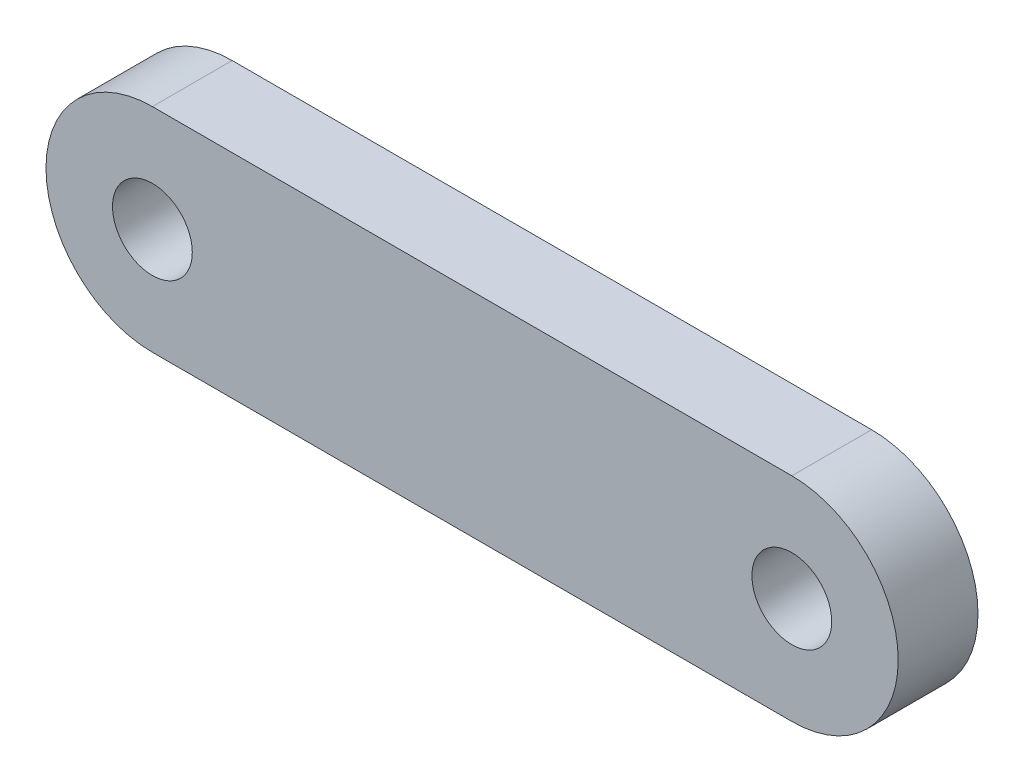
ISO-10303-21;
HEADER;
FILE_DESCRIPTION(('STEP AP214'),'2;1');
FILE_NAME('part.step','',(''),(''),'','','');
FILE_SCHEMA(('AUTOMOTIVE_DESIGN { 1 0 10303 214 1 1 1 1 }'));
ENDSEC;
DATA;
#1=APPLICATION_CONTEXT('core data for automotive mechanical design processes');
#2=APPLICATION_PROTOCOL_DEFINITION('international standard','automotive_design',2000,#1);
#3=PRODUCT_CONTEXT('',#1,'mechanical');
#4=PRODUCT('Part','Part','',(#3));
#5=PRODUCT_RELATED_PRODUCT_CATEGORY('part','',(#4));
#6=PRODUCT_DEFINITION_FORMATION('','',#4);
#7=PRODUCT_DEFINITION_CONTEXT('part definition',#1,'design');
#8=PRODUCT_DEFINITION('design','',#6,#7);
#9=PRODUCT_DEFINITION_SHAPE('','',#8);
#10=(LENGTH_UNIT() NAMED_UNIT(*) SI_UNIT(.MILLI.,.METRE.));
#11=(NAMED_UNIT(*) PLANE_ANGLE_UNIT() SI_UNIT($,.RADIAN.));
#12=(NAMED_UNIT(*) SI_UNIT($,.STERADIAN.) SOLID_ANGLE_UNIT());
#13=UNCERTAINTY_MEASURE_WITH_UNIT(LENGTH_MEASURE(1.E-05),#10,'distance_accuracy_value','');
#14=(GEOMETRIC_REPRESENTATION_CONTEXT(3) GLOBAL_UNCERTAINTY_ASSIGNED_CONTEXT((#13)) GLOBAL_UNIT_ASSIGNED_CONTEXT((#10,
#11,#12)) REPRESENTATION_CONTEXT('',''));
#15=CARTESIAN_POINT('',(0.,0.,0.));
#16=DIRECTION('',(0.,0.,1.));
#17=DIRECTION('',(1.,0.,0.));
#18=AXIS2_PLACEMENT_3D('',#15,#16,#17);
#19=CARTESIAN_POINT('',(0.,0.,0.75));
#20=DIRECTION('',(0.,0.,1.));
#21=DIRECTION('',(1.,0.,0.));
#22=AXIS2_PLACEMENT_3D('',#19,#20,#21);
#23=PLANE('',#22);
#24=CARTESIAN_POINT('',(0.,0.,0.75));
#25=DIRECTION('',(0.,0.,-1.));
#26=DIRECTION('',(1.,0.,0.));
#27=AXIS2_PLACEMENT_3D('',#24,#25,#26);
#28=CIRCLE('',#27,0.75);
#29=CARTESIAN_POINT('',(0.75,0.,0.75));
#30=VERTEX_POINT('',#29);
#31=EDGE_CURVE('E105',#30,#30,#28,.T.);
#32=ORIENTED_EDGE('',*,*,#31,.T.);
#33=EDGE_LOOP('',(#32));
#34=FACE_BOUND('',#33,.T.);
#35=CARTESIAN_POINT('',(0.,0.,0.75));
#36=DIRECTION('',(0.,0.,-1.));
#37=DIRECTION('',(1.,0.,0.));
#38=AXIS2_PLACEMENT_3D('',#35,#36,#37);
#39=CIRCLE('',#38,2.);
#40=CARTESIAN_POINT('',(0.,-2.,0.75));
#41=VERTEX_POINT('',#40);
#42=CARTESIAN_POINT('',(0.,2.,0.75));
#43=VERTEX_POINT('',#42);
#44=EDGE_CURVE('E93',#41,#43,#39,.T.);
#45=ORIENTED_EDGE('',*,*,#44,.F.);
#46=DIRECTION('',(-1.,0.,0.));
#47=VECTOR('',#46,1.);
#48=CARTESIAN_POINT('',(0.,-2.,0.75));
#49=LINE('',#48,#47);
#50=CARTESIAN_POINT('',(12.02,-2.,0.75));
#51=VERTEX_POINT('',#50);
#52=EDGE_CURVE('E96',#51,#41,#49,.T.);
#53=ORIENTED_EDGE('',*,*,#52,.F.);
#54=CARTESIAN_POINT('',(12.02,0.,0.75));
#55=DIRECTION('',(0.,0.,-1.));
#56=DIRECTION('',(1.,0.,0.));
#57=AXIS2_PLACEMENT_3D('',#54,#55,#56);
#58=CIRCLE('',#57,2.);
#59=CARTESIAN_POINT('',(12.02,2.,0.75));
#60=VERTEX_POINT('',#59);
#61=EDGE_CURVE('E84',#60,#51,#58,.T.);
#62=ORIENTED_EDGE('',*,*,#61,.F.);
#63=DIRECTION('',(1.,0.,0.));
#64=VECTOR('',#63,1.);
#65=CARTESIAN_POINT('',(0.,2.,0.75));
#66=LINE('',#65,#64);
#67=EDGE_CURVE('E89',#43,#60,#66,.T.);
#68=ORIENTED_EDGE('',*,*,#67,.F.);
#69=EDGE_LOOP('',(#45,#53,#62,#68));
#70=FACE_BOUND('',#69,.T.);
#71=CARTESIAN_POINT('',(12.02,0.,0.75));
#72=DIRECTION('',(0.,0.,-1.));
#73=DIRECTION('',(1.,0.,0.));
#74=AXIS2_PLACEMENT_3D('',#71,#72,#73);
#75=CIRCLE('',#74,0.750000000000002);
#76=CARTESIAN_POINT('',(12.77,0.,0.75));
#77=VERTEX_POINT('',#76);
#78=EDGE_CURVE('E116',#77,#77,#75,.T.);
#79=ORIENTED_EDGE('',*,*,#78,.T.);
#80=EDGE_LOOP('',(#79));
#81=FACE_BOUND('',#80,.T.);
#82=ADVANCED_FACE('F37',(#34,#70,#81),#23,.T.);
#83=CARTESIAN_POINT('',(0.,0.,-0.75));
#84=DIRECTION('',(0.,0.,1.));
#85=DIRECTION('',(1.,0.,0.));
#86=AXIS2_PLACEMENT_3D('',#83,#84,#85);
#87=PLANE('',#86);
#88=CARTESIAN_POINT('',(0.,0.,-0.75));
#89=DIRECTION('',(0.,0.,-1.));
#90=DIRECTION('',(1.,0.,0.));
#91=AXIS2_PLACEMENT_3D('',#88,#89,#90);
#92=CIRCLE('',#91,2.);
#93=CARTESIAN_POINT('',(0.,-2.,-0.75));
#94=VERTEX_POINT('',#93);
#95=CARTESIAN_POINT('',(0.,2.,-0.75));
#96=VERTEX_POINT('',#95);
#97=EDGE_CURVE('E101',#94,#96,#92,.T.);
#98=ORIENTED_EDGE('',*,*,#97,.T.);
#99=DIRECTION('',(1.,0.,0.));
#100=VECTOR('',#99,1.);
#101=CARTESIAN_POINT('',(0.,2.,-0.75));
#102=LINE('',#101,#100);
#103=CARTESIAN_POINT('',(12.02,2.,-0.75));
#104=VERTEX_POINT('',#103);
#105=EDGE_CURVE('E104',#96,#104,#102,.T.);
#106=ORIENTED_EDGE('',*,*,#105,.T.);
#107=CARTESIAN_POINT('',(12.02,0.,-0.75));
#108=DIRECTION('',(0.,0.,-1.));
#109=DIRECTION('',(1.,0.,0.));
#110=AXIS2_PLACEMENT_3D('',#107,#108,#109);
#111=CIRCLE('',#110,2.);
#112=CARTESIAN_POINT('',(12.02,-2.,-0.75));
#113=VERTEX_POINT('',#112);
#114=EDGE_CURVE('E87',#104,#113,#111,.T.);
#115=ORIENTED_EDGE('',*,*,#114,.T.);
#116=DIRECTION('',(-1.,0.,0.));
#117=VECTOR('',#116,1.);
#118=CARTESIAN_POINT('',(0.,-2.,-0.75));
#119=LINE('',#118,#117);
#120=EDGE_CURVE('E108',#113,#94,#119,.T.);
#121=ORIENTED_EDGE('',*,*,#120,.T.);
#122=EDGE_LOOP('',(#98,#106,#115,#121));
#123=FACE_BOUND('',#122,.T.);
#124=CARTESIAN_POINT('',(0.,0.,-0.75));
#125=DIRECTION('',(0.,0.,-1.));
#126=DIRECTION('',(1.,0.,0.));
#127=AXIS2_PLACEMENT_3D('',#124,#125,#126);
#128=CIRCLE('',#127,0.75);
#129=CARTESIAN_POINT('',(0.75,0.,-0.75));
#130=VERTEX_POINT('',#129);
#131=EDGE_CURVE('E113',#130,#130,#128,.T.);
#132=ORIENTED_EDGE('',*,*,#131,.F.);
#133=EDGE_LOOP('',(#132));
#134=FACE_BOUND('',#133,.T.);
#135=CARTESIAN_POINT('',(12.02,0.,-0.75));
#136=DIRECTION('',(0.,0.,-1.));
#137=DIRECTION('',(1.,0.,0.));
#138=AXIS2_PLACEMENT_3D('',#135,#136,#137);
#139=CIRCLE('',#138,0.750000000000002);
#140=CARTESIAN_POINT('',(12.77,0.,-0.75));
#141=VERTEX_POINT('',#140);
#142=EDGE_CURVE('E119',#141,#141,#139,.T.);
#143=ORIENTED_EDGE('',*,*,#142,.F.);
#144=EDGE_LOOP('',(#143));
#145=FACE_BOUND('',#144,.T.);
#146=ADVANCED_FACE('F132',(#123,#134,#145),#87,.F.);
#147=CARTESIAN_POINT('',(0.,0.,0.75));
#148=DIRECTION('',(0.,0.,-1.));
#149=DIRECTION('',(-1.,0.,0.));
#150=AXIS2_PLACEMENT_3D('',#147,#148,#149);
#151=CYLINDRICAL_SURFACE('',#150,2.);
#152=ORIENTED_EDGE('',*,*,#97,.F.);
#153=DIRECTION('',(0.,0.,-1.));
#154=VECTOR('',#153,1.);
#155=CARTESIAN_POINT('',(0.,-2.,0.75));
#156=LINE('',#155,#154);
#157=EDGE_CURVE('E54',#41,#94,#156,.T.);
#158=ORIENTED_EDGE('',*,*,#157,.F.);
#159=ORIENTED_EDGE('',*,*,#44,.T.);
#160=DIRECTION('',(0.,0.,-1.));
#161=VECTOR('',#160,1.);
#162=CARTESIAN_POINT('',(0.,2.,0.75));
#163=LINE('',#162,#161);
#164=EDGE_CURVE('E11',#43,#96,#163,.T.);
#165=ORIENTED_EDGE('',*,*,#164,.T.);
#166=EDGE_LOOP('',(#152,#158,#159,#165));
#167=FACE_BOUND('',#166,.T.);
#168=ADVANCED_FACE('F39',(#167),#151,.T.);
#169=CARTESIAN_POINT('',(0.,2.,0.75));
#170=DIRECTION('',(0.,-1.,0.));
#171=DIRECTION('',(0.,0.,1.));
#172=AXIS2_PLACEMENT_3D('',#169,#170,#171);
#173=PLANE('',#172);
#174=ORIENTED_EDGE('',*,*,#105,.F.);
#175=ORIENTED_EDGE('',*,*,#164,.F.);
#176=ORIENTED_EDGE('',*,*,#67,.T.);
#177=DIRECTION('',(0.,0.,-1.));
#178=VECTOR('',#177,1.);
#179=CARTESIAN_POINT('',(12.02,2.,0.75));
#180=LINE('',#179,#178);
#181=EDGE_CURVE('E46',#60,#104,#180,.T.);
#182=ORIENTED_EDGE('',*,*,#181,.T.);
#183=EDGE_LOOP('',(#174,#175,#176,#182));
#184=FACE_BOUND('',#183,.T.);
#185=ADVANCED_FACE('F90',(#184),#173,.F.);
#186=CARTESIAN_POINT('',(12.02,0.,0.75));
#187=DIRECTION('',(0.,0.,-1.));
#188=DIRECTION('',(-1.,0.,0.));
#189=AXIS2_PLACEMENT_3D('',#186,#187,#188);
#190=CYLINDRICAL_SURFACE('',#189,2.);
#191=ORIENTED_EDGE('',*,*,#114,.F.);
#192=ORIENTED_EDGE('',*,*,#181,.F.);
#193=ORIENTED_EDGE('',*,*,#61,.T.);
#194=DIRECTION('',(0.,0.,-1.));
#195=VECTOR('',#194,1.);
#196=CARTESIAN_POINT('',(12.02,-2.,0.75));
#197=LINE('',#196,#195);
#198=EDGE_CURVE('E70',#51,#113,#197,.T.);
#199=ORIENTED_EDGE('',*,*,#198,.T.);
#200=EDGE_LOOP('',(#191,#192,#193,#199));
#201=FACE_BOUND('',#200,.T.);
#202=ADVANCED_FACE('F82',(#201),#190,.T.);
#203=CARTESIAN_POINT('',(0.,-2.,0.75));
#204=DIRECTION('',(0.,1.,0.));
#205=DIRECTION('',(0.,0.,-1.));
#206=AXIS2_PLACEMENT_3D('',#203,#204,#205);
#207=PLANE('',#206);
#208=ORIENTED_EDGE('',*,*,#120,.F.);
#209=ORIENTED_EDGE('',*,*,#198,.F.);
#210=ORIENTED_EDGE('',*,*,#52,.T.);
#211=ORIENTED_EDGE('',*,*,#157,.T.);
#212=EDGE_LOOP('',(#208,#209,#210,#211));
#213=FACE_BOUND('',#212,.T.);
#214=ADVANCED_FACE('F144',(#213),#207,.F.);
#215=CARTESIAN_POINT('',(0.,0.,0.75));
#216=DIRECTION('',(0.,0.,-1.));
#217=DIRECTION('',(-1.,0.,0.));
#218=AXIS2_PLACEMENT_3D('',#215,#216,#217);
#219=CYLINDRICAL_SURFACE('',#218,0.75);
#220=ORIENTED_EDGE('',*,*,#31,.F.);
#221=EDGE_LOOP('',(#220));
#222=FACE_BOUND('',#221,.T.);
#223=ORIENTED_EDGE('',*,*,#131,.T.);
#224=EDGE_LOOP('',(#223));
#225=FACE_BOUND('',#224,.T.);
#226=ADVANCED_FACE('F128',(#222,#225),#219,.F.);
#227=CARTESIAN_POINT('',(12.02,0.,0.75));
#228=DIRECTION('',(0.,0.,-1.));
#229=DIRECTION('',(-1.,0.,0.));
#230=AXIS2_PLACEMENT_3D('',#227,#228,#229);
#231=CYLINDRICAL_SURFACE('',#230,0.750000000000002);
#232=ORIENTED_EDGE('',*,*,#78,.F.);
#233=EDGE_LOOP('',(#232));
#234=FACE_BOUND('',#233,.T.);
#235=ORIENTED_EDGE('',*,*,#142,.T.);
#236=EDGE_LOOP('',(#235));
#237=FACE_BOUND('',#236,.T.);
#238=ADVANCED_FACE('F125',(#234,#237),#231,.F.);
#239=CLOSED_SHELL('',(#82,#146,#168,#185,#202,#214,#226,#238));
#240=MANIFOLD_SOLID_BREP('B2',#239);
#241=ADVANCED_BREP_SHAPE_REPRESENTATION('',(#18,#240),#14);
#242=SHAPE_DEFINITION_REPRESENTATION(#9,#241);
ENDSEC;
END-ISO-10303-21;
